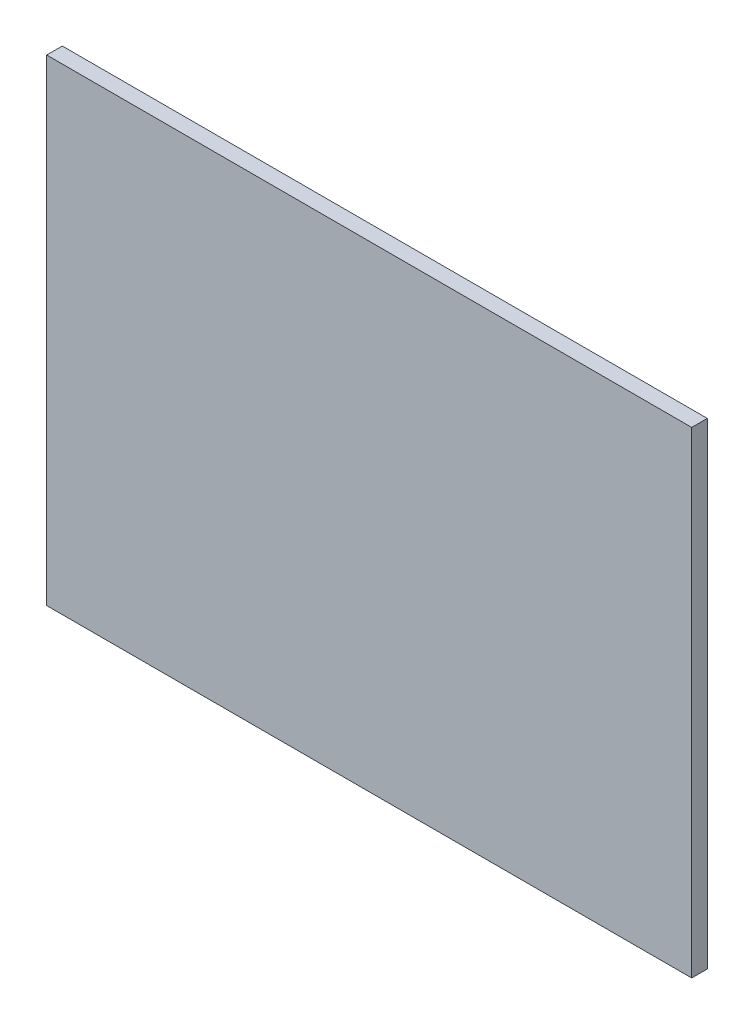
ISO-10303-21;
HEADER;
FILE_DESCRIPTION(('STEP AP214'),'2;1');
FILE_NAME('part.step','',(''),(''),'','','');
FILE_SCHEMA(('AUTOMOTIVE_DESIGN { 1 0 10303 214 1 1 1 1 }'));
ENDSEC;
DATA;
#1=APPLICATION_CONTEXT('core data for automotive mechanical design processes');
#2=APPLICATION_PROTOCOL_DEFINITION('international standard','automotive_design',2000,#1);
#3=PRODUCT_CONTEXT('',#1,'mechanical');
#4=PRODUCT('Part','Part','',(#3));
#5=PRODUCT_RELATED_PRODUCT_CATEGORY('part','',(#4));
#6=PRODUCT_DEFINITION_FORMATION('','',#4);
#7=PRODUCT_DEFINITION_CONTEXT('part definition',#1,'design');
#8=PRODUCT_DEFINITION('design','',#6,#7);
#9=PRODUCT_DEFINITION_SHAPE('','',#8);
#10=(LENGTH_UNIT() NAMED_UNIT(*) SI_UNIT(.MILLI.,.METRE.));
#11=(NAMED_UNIT(*) PLANE_ANGLE_UNIT() SI_UNIT($,.RADIAN.));
#12=(NAMED_UNIT(*) SI_UNIT($,.STERADIAN.) SOLID_ANGLE_UNIT());
#13=UNCERTAINTY_MEASURE_WITH_UNIT(LENGTH_MEASURE(1.E-05),#10,'distance_accuracy_value','');
#14=(GEOMETRIC_REPRESENTATION_CONTEXT(3) GLOBAL_UNCERTAINTY_ASSIGNED_CONTEXT((#13)) GLOBAL_UNIT_ASSIGNED_CONTEXT((#10,
#11,#12)) REPRESENTATION_CONTEXT('',''));
#15=CARTESIAN_POINT('',(0.,0.,0.));
#16=DIRECTION('',(0.,0.,1.));
#17=DIRECTION('',(1.,0.,0.));
#18=AXIS2_PLACEMENT_3D('',#15,#16,#17);
#19=CARTESIAN_POINT('',(-372.,-275.,18.));
#20=DIRECTION('',(1.,0.,0.));
#21=DIRECTION('',(0.,0.,-1.));
#22=AXIS2_PLACEMENT_3D('',#19,#20,#21);
#23=PLANE('',#22);
#24=DIRECTION('',(0.,-1.,0.));
#25=VECTOR('',#24,1.);
#26=CARTESIAN_POINT('',(-372.,-275.,0.));
#27=LINE('',#26,#25);
#28=CARTESIAN_POINT('',(-372.,275.,0.));
#29=VERTEX_POINT('',#28);
#30=CARTESIAN_POINT('',(-372.,-275.,0.));
#31=VERTEX_POINT('',#30);
#32=EDGE_CURVE('E96',#29,#31,#27,.T.);
#33=ORIENTED_EDGE('',*,*,#32,.T.);
#34=DIRECTION('',(0.,0.,-1.));
#35=VECTOR('',#34,1.);
#36=CARTESIAN_POINT('',(-372.,-275.,18.));
#37=LINE('',#36,#35);
#38=CARTESIAN_POINT('',(-372.,-275.,18.));
#39=VERTEX_POINT('',#38);
#40=EDGE_CURVE('E11',#39,#31,#37,.T.);
#41=ORIENTED_EDGE('',*,*,#40,.F.);
#42=DIRECTION('',(0.,-1.,0.));
#43=VECTOR('',#42,1.);
#44=CARTESIAN_POINT('',(-372.,-275.,18.));
#45=LINE('',#44,#43);
#46=CARTESIAN_POINT('',(-372.,275.,18.));
#47=VERTEX_POINT('',#46);
#48=EDGE_CURVE('E84',#47,#39,#45,.T.);
#49=ORIENTED_EDGE('',*,*,#48,.F.);
#50=DIRECTION('',(0.,0.,-1.));
#51=VECTOR('',#50,1.);
#52=CARTESIAN_POINT('',(-372.,275.,18.));
#53=LINE('',#52,#51);
#54=EDGE_CURVE('E92',#47,#29,#53,.T.);
#55=ORIENTED_EDGE('',*,*,#54,.T.);
#56=EDGE_LOOP('',(#33,#41,#49,#55));
#57=FACE_BOUND('',#56,.T.);
#58=ADVANCED_FACE('F33',(#57),#23,.F.);
#59=CARTESIAN_POINT('',(372.,-275.,18.));
#60=DIRECTION('',(0.,1.,0.));
#61=DIRECTION('',(-1.,0.,0.));
#62=AXIS2_PLACEMENT_3D('',#59,#60,#61);
#63=PLANE('',#62);
#64=DIRECTION('',(1.,0.,0.));
#65=VECTOR('',#64,1.);
#66=CARTESIAN_POINT('',(372.,-275.,0.));
#67=LINE('',#66,#65);
#68=CARTESIAN_POINT('',(372.,-275.,0.));
#69=VERTEX_POINT('',#68);
#70=EDGE_CURVE('E88',#31,#69,#67,.T.);
#71=ORIENTED_EDGE('',*,*,#70,.T.);
#72=DIRECTION('',(0.,0.,-1.));
#73=VECTOR('',#72,1.);
#74=CARTESIAN_POINT('',(372.,-275.,18.));
#75=LINE('',#74,#73);
#76=CARTESIAN_POINT('',(372.,-275.,18.));
#77=VERTEX_POINT('',#76);
#78=EDGE_CURVE('E41',#77,#69,#75,.T.);
#79=ORIENTED_EDGE('',*,*,#78,.F.);
#80=DIRECTION('',(1.,0.,0.));
#81=VECTOR('',#80,1.);
#82=CARTESIAN_POINT('',(372.,-275.,18.));
#83=LINE('',#82,#81);
#84=EDGE_CURVE('E79',#39,#77,#83,.T.);
#85=ORIENTED_EDGE('',*,*,#84,.F.);
#86=ORIENTED_EDGE('',*,*,#40,.T.);
#87=EDGE_LOOP('',(#71,#79,#85,#86));
#88=FACE_BOUND('',#87,.T.);
#89=ADVANCED_FACE('F87',(#88),#63,.F.);
#90=CARTESIAN_POINT('',(372.,-275.,18.));
#91=DIRECTION('',(-1.,0.,0.));
#92=DIRECTION('',(0.,0.,1.));
#93=AXIS2_PLACEMENT_3D('',#90,#91,#92);
#94=PLANE('',#93);
#95=DIRECTION('',(0.,1.,0.));
#96=VECTOR('',#95,1.);
#97=CARTESIAN_POINT('',(372.,-275.,0.));
#98=LINE('',#97,#96);
#99=CARTESIAN_POINT('',(372.,275.,0.));
#100=VERTEX_POINT('',#99);
#101=EDGE_CURVE('E66',#69,#100,#98,.T.);
#102=ORIENTED_EDGE('',*,*,#101,.T.);
#103=DIRECTION('',(0.,0.,-1.));
#104=VECTOR('',#103,1.);
#105=CARTESIAN_POINT('',(372.,275.,18.));
#106=LINE('',#105,#104);
#107=CARTESIAN_POINT('',(372.,275.,18.));
#108=VERTEX_POINT('',#107);
#109=EDGE_CURVE('E89',#108,#100,#106,.T.);
#110=ORIENTED_EDGE('',*,*,#109,.F.);
#111=DIRECTION('',(0.,1.,0.));
#112=VECTOR('',#111,1.);
#113=CARTESIAN_POINT('',(372.,-275.,18.));
#114=LINE('',#113,#112);
#115=EDGE_CURVE('E82',#77,#108,#114,.T.);
#116=ORIENTED_EDGE('',*,*,#115,.F.);
#117=ORIENTED_EDGE('',*,*,#78,.T.);
#118=EDGE_LOOP('',(#102,#110,#116,#117));
#119=FACE_BOUND('',#118,.T.);
#120=ADVANCED_FACE('F90',(#119),#94,.F.);
#121=CARTESIAN_POINT('',(372.,275.,18.));
#122=DIRECTION('',(0.,-1.,0.));
#123=DIRECTION('',(1.,0.,0.));
#124=AXIS2_PLACEMENT_3D('',#121,#122,#123);
#125=PLANE('',#124);
#126=DIRECTION('',(-1.,0.,0.));
#127=VECTOR('',#126,1.);
#128=CARTESIAN_POINT('',(372.,275.,0.));
#129=LINE('',#128,#127);
#130=EDGE_CURVE('E72',#100,#29,#129,.T.);
#131=ORIENTED_EDGE('',*,*,#130,.T.);
#132=ORIENTED_EDGE('',*,*,#54,.F.);
#133=DIRECTION('',(-1.,0.,0.));
#134=VECTOR('',#133,1.);
#135=CARTESIAN_POINT('',(372.,275.,18.));
#136=LINE('',#135,#134);
#137=EDGE_CURVE('E49',#108,#47,#136,.T.);
#138=ORIENTED_EDGE('',*,*,#137,.F.);
#139=ORIENTED_EDGE('',*,*,#109,.T.);
#140=EDGE_LOOP('',(#131,#132,#138,#139));
#141=FACE_BOUND('',#140,.T.);
#142=ADVANCED_FACE('F103',(#141),#125,.F.);
#143=CARTESIAN_POINT('',(0.,0.,18.));
#144=DIRECTION('',(0.,0.,1.));
#145=DIRECTION('',(1.,0.,0.));
#146=AXIS2_PLACEMENT_3D('',#143,#144,#145);
#147=PLANE('',#146);
#148=ORIENTED_EDGE('',*,*,#48,.T.);
#149=ORIENTED_EDGE('',*,*,#84,.T.);
#150=ORIENTED_EDGE('',*,*,#115,.T.);
#151=ORIENTED_EDGE('',*,*,#137,.T.);
#152=EDGE_LOOP('',(#148,#149,#150,#151));
#153=FACE_BOUND('',#152,.T.);
#154=ADVANCED_FACE('F80',(#153),#147,.T.);
#155=CARTESIAN_POINT('',(0.,0.,0.));
#156=DIRECTION('',(0.,0.,1.));
#157=DIRECTION('',(1.,0.,0.));
#158=AXIS2_PLACEMENT_3D('',#155,#156,#157);
#159=PLANE('',#158);
#160=ORIENTED_EDGE('',*,*,#32,.F.);
#161=ORIENTED_EDGE('',*,*,#130,.F.);
#162=ORIENTED_EDGE('',*,*,#101,.F.);
#163=ORIENTED_EDGE('',*,*,#70,.F.);
#164=EDGE_LOOP('',(#160,#161,#162,#163));
#165=FACE_BOUND('',#164,.T.);
#166=ADVANCED_FACE('F106',(#165),#159,.F.);
#167=CLOSED_SHELL('',(#58,#89,#120,#142,#154,#166));
#168=MANIFOLD_SOLID_BREP('B2',#167);
#169=ADVANCED_BREP_SHAPE_REPRESENTATION('',(#18,#168),#14);
#170=SHAPE_DEFINITION_REPRESENTATION(#9,#169);
ENDSEC;
END-ISO-10303-21;
